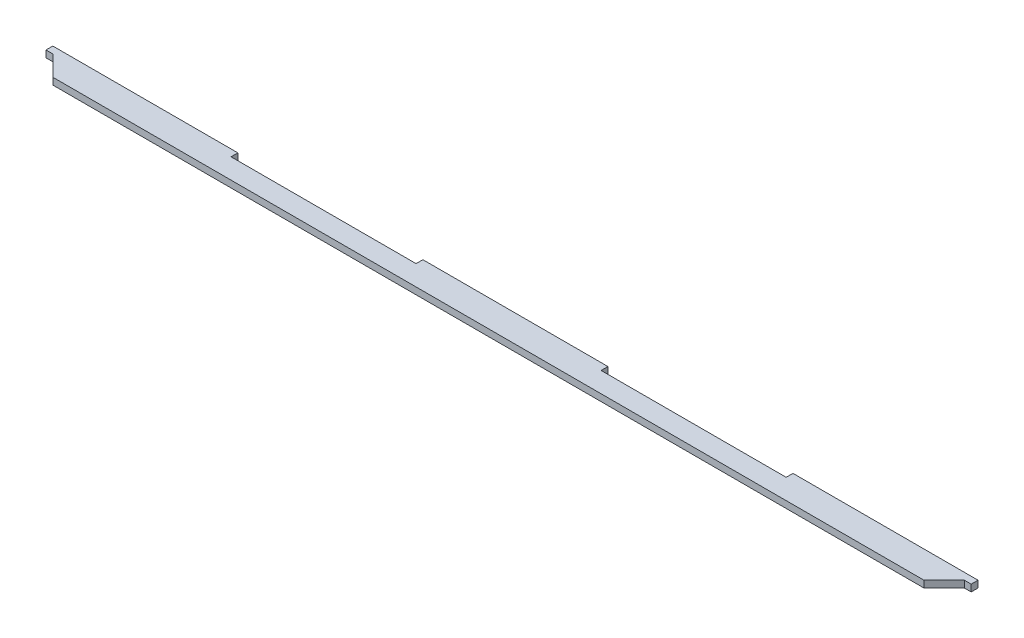
ISO-10303-21;
HEADER;
FILE_DESCRIPTION(('STEP AP214'),'2;1');
FILE_NAME('part.step','',(''),(''),'','','');
FILE_SCHEMA(('AUTOMOTIVE_DESIGN { 1 0 10303 214 1 1 1 1 }'));
ENDSEC;
DATA;
#1=APPLICATION_CONTEXT('core data for automotive mechanical design processes');
#2=APPLICATION_PROTOCOL_DEFINITION('international standard','automotive_design',2000,#1);
#3=PRODUCT_CONTEXT('',#1,'mechanical');
#4=PRODUCT('Part','Part','',(#3));
#5=PRODUCT_RELATED_PRODUCT_CATEGORY('part','',(#4));
#6=PRODUCT_DEFINITION_FORMATION('','',#4);
#7=PRODUCT_DEFINITION_CONTEXT('part definition',#1,'design');
#8=PRODUCT_DEFINITION('design','',#6,#7);
#9=PRODUCT_DEFINITION_SHAPE('','',#8);
#10=(LENGTH_UNIT() NAMED_UNIT(*) SI_UNIT(.MILLI.,.METRE.));
#11=(NAMED_UNIT(*) PLANE_ANGLE_UNIT() SI_UNIT($,.RADIAN.));
#12=(NAMED_UNIT(*) SI_UNIT($,.STERADIAN.) SOLID_ANGLE_UNIT());
#13=UNCERTAINTY_MEASURE_WITH_UNIT(LENGTH_MEASURE(1.E-05),#10,'distance_accuracy_value','');
#14=(GEOMETRIC_REPRESENTATION_CONTEXT(3) GLOBAL_UNCERTAINTY_ASSIGNED_CONTEXT((#13)) GLOBAL_UNIT_ASSIGNED_CONTEXT((#10,
#11,#12)) REPRESENTATION_CONTEXT('',''));
#15=CARTESIAN_POINT('',(0.,0.,0.));
#16=DIRECTION('',(0.,0.,1.));
#17=DIRECTION('',(1.,0.,0.));
#18=AXIS2_PLACEMENT_3D('',#15,#16,#17);
#19=CARTESIAN_POINT('',(-183.2,2.7,-5.10559156911942));
#20=DIRECTION('',(1.,0.,0.));
#21=DIRECTION('',(0.,0.,-1.));
#22=AXIS2_PLACEMENT_3D('',#19,#20,#21);
#23=PLANE('',#22);
#24=DIRECTION('',(0.,0.,1.));
#25=VECTOR('',#24,1.);
#26=CARTESIAN_POINT('',(-183.2,0.,-5.10559156911942));
#27=LINE('',#26,#25);
#28=CARTESIAN_POINT('',(-183.2,0.,-5.10559156911942));
#29=VERTEX_POINT('',#28);
#30=CARTESIAN_POINT('',(-183.2,0.,-2.40559156911942));
#31=VERTEX_POINT('',#30);
#32=EDGE_CURVE('E177',#29,#31,#27,.T.);
#33=ORIENTED_EDGE('',*,*,#32,.T.);
#34=DIRECTION('',(0.,-1.,0.));
#35=VECTOR('',#34,1.);
#36=CARTESIAN_POINT('',(-183.2,2.7,-2.40559156911942));
#37=LINE('',#36,#35);
#38=CARTESIAN_POINT('',(-183.2,2.7,-2.40559156911942));
#39=VERTEX_POINT('',#38);
#40=EDGE_CURVE('E11',#39,#31,#37,.T.);
#41=ORIENTED_EDGE('',*,*,#40,.F.);
#42=DIRECTION('',(0.,0.,1.));
#43=VECTOR('',#42,1.);
#44=CARTESIAN_POINT('',(-183.2,2.7,-5.10559156911942));
#45=LINE('',#44,#43);
#46=CARTESIAN_POINT('',(-183.2,2.7,-5.10559156911942));
#47=VERTEX_POINT('',#46);
#48=EDGE_CURVE('E207',#47,#39,#45,.T.);
#49=ORIENTED_EDGE('',*,*,#48,.F.);
#50=DIRECTION('',(0.,-1.,0.));
#51=VECTOR('',#50,1.);
#52=CARTESIAN_POINT('',(-183.2,2.7,-5.10559156911942));
#53=LINE('',#52,#51);
#54=EDGE_CURVE('E173',#47,#29,#53,.T.);
#55=ORIENTED_EDGE('',*,*,#54,.T.);
#56=EDGE_LOOP('',(#33,#41,#49,#55));
#57=FACE_BOUND('',#56,.T.);
#58=ADVANCED_FACE('F33',(#57),#23,.F.);
#59=CARTESIAN_POINT('',(-183.2,2.7,-2.40559156911942));
#60=DIRECTION('',(0.,0.,-1.));
#61=DIRECTION('',(-1.,0.,0.));
#62=AXIS2_PLACEMENT_3D('',#59,#60,#61);
#63=PLANE('',#62);
#64=DIRECTION('',(1.,0.,0.));
#65=VECTOR('',#64,1.);
#66=CARTESIAN_POINT('',(-183.2,0.,-2.40559156911942));
#67=LINE('',#66,#65);
#68=CARTESIAN_POINT('',(-180.5,0.,-2.40559156911942));
#69=VERTEX_POINT('',#68);
#70=EDGE_CURVE('E180',#31,#69,#67,.T.);
#71=ORIENTED_EDGE('',*,*,#70,.T.);
#72=DIRECTION('',(0.,-1.,0.));
#73=VECTOR('',#72,1.);
#74=CARTESIAN_POINT('',(-180.5,2.7,-2.40559156911942));
#75=LINE('',#74,#73);
#76=CARTESIAN_POINT('',(-180.5,2.7,-2.40559156911942));
#77=VERTEX_POINT('',#76);
#78=EDGE_CURVE('E41',#77,#69,#75,.T.);
#79=ORIENTED_EDGE('',*,*,#78,.F.);
#80=DIRECTION('',(1.,0.,0.));
#81=VECTOR('',#80,1.);
#82=CARTESIAN_POINT('',(-183.2,2.7,-2.40559156911942));
#83=LINE('',#82,#81);
#84=EDGE_CURVE('E116',#39,#77,#83,.T.);
#85=ORIENTED_EDGE('',*,*,#84,.F.);
#86=ORIENTED_EDGE('',*,*,#40,.T.);
#87=EDGE_LOOP('',(#71,#79,#85,#86));
#88=FACE_BOUND('',#87,.T.);
#89=ADVANCED_FACE('F305',(#88),#63,.F.);
#90=CARTESIAN_POINT('',(-180.5,2.7,-2.40559156911942));
#91=DIRECTION('',(0.707106781186539,0.,-0.707106781186556));
#92=DIRECTION('',(-0.707106781186556,0.,-0.707106781186539));
#93=AXIS2_PLACEMENT_3D('',#90,#91,#92);
#94=PLANE('',#93);
#95=DIRECTION('',(0.707106781186556,0.,0.707106781186539));
#96=VECTOR('',#95,1.);
#97=CARTESIAN_POINT('',(-180.5,0.,-2.40559156911942));
#98=LINE('',#97,#96);
#99=CARTESIAN_POINT('',(-172.5,0.,5.59440843088058));
#100=VERTEX_POINT('',#99);
#101=EDGE_CURVE('E182',#69,#100,#98,.T.);
#102=ORIENTED_EDGE('',*,*,#101,.T.);
#103=DIRECTION('',(0.,-1.,0.));
#104=VECTOR('',#103,1.);
#105=CARTESIAN_POINT('',(-172.5,2.7,5.59440843088058));
#106=LINE('',#105,#104);
#107=CARTESIAN_POINT('',(-172.5,2.7,5.59440843088058));
#108=VERTEX_POINT('',#107);
#109=EDGE_CURVE('E238',#108,#100,#106,.T.);
#110=ORIENTED_EDGE('',*,*,#109,.F.);
#111=DIRECTION('',(0.707106781186556,0.,0.707106781186539));
#112=VECTOR('',#111,1.);
#113=CARTESIAN_POINT('',(-180.5,2.7,-2.40559156911942));
#114=LINE('',#113,#112);
#115=EDGE_CURVE('E246',#77,#108,#114,.T.);
#116=ORIENTED_EDGE('',*,*,#115,.F.);
#117=ORIENTED_EDGE('',*,*,#78,.T.);
#118=EDGE_LOOP('',(#102,#110,#116,#117));
#119=FACE_BOUND('',#118,.T.);
#120=ADVANCED_FACE('F244',(#119),#94,.F.);
#121=CARTESIAN_POINT('',(-172.5,2.7,5.59440843088058));
#122=DIRECTION('',(0.,0.,-1.));
#123=DIRECTION('',(-1.,0.,0.));
#124=AXIS2_PLACEMENT_3D('',#121,#122,#123);
#125=PLANE('',#124);
#126=DIRECTION('',(1.,0.,0.));
#127=VECTOR('',#126,1.);
#128=CARTESIAN_POINT('',(-172.5,0.,5.59440843088058));
#129=LINE('',#128,#127);
#130=CARTESIAN_POINT('',(172.5,0.,5.59440843088058));
#131=VERTEX_POINT('',#130);
#132=EDGE_CURVE('E184',#100,#131,#129,.T.);
#133=ORIENTED_EDGE('',*,*,#132,.T.);
#134=DIRECTION('',(0.,-1.,0.));
#135=VECTOR('',#134,1.);
#136=CARTESIAN_POINT('',(172.5,2.7,5.59440843088058));
#137=LINE('',#136,#135);
#138=CARTESIAN_POINT('',(172.5,2.7,5.59440843088058));
#139=VERTEX_POINT('',#138);
#140=EDGE_CURVE('E235',#139,#131,#137,.T.);
#141=ORIENTED_EDGE('',*,*,#140,.F.);
#142=DIRECTION('',(1.,0.,0.));
#143=VECTOR('',#142,1.);
#144=CARTESIAN_POINT('',(-172.5,2.7,5.59440843088058));
#145=LINE('',#144,#143);
#146=EDGE_CURVE('E264',#108,#139,#145,.T.);
#147=ORIENTED_EDGE('',*,*,#146,.F.);
#148=ORIENTED_EDGE('',*,*,#109,.T.);
#149=EDGE_LOOP('',(#133,#141,#147,#148));
#150=FACE_BOUND('',#149,.T.);
#151=ADVANCED_FACE('F255',(#150),#125,.F.);
#152=CARTESIAN_POINT('',(180.5,2.7,-2.40559156911942));
#153=DIRECTION('',(-0.707106781186539,0.,-0.707106781186556));
#154=DIRECTION('',(-0.707106781186556,0.,0.707106781186539));
#155=AXIS2_PLACEMENT_3D('',#152,#153,#154);
#156=PLANE('',#155);
#157=DIRECTION('',(0.707106781186556,0.,-0.707106781186539));
#158=VECTOR('',#157,1.);
#159=CARTESIAN_POINT('',(180.5,0.,-2.40559156911942));
#160=LINE('',#159,#158);
#161=CARTESIAN_POINT('',(180.5,0.,-2.40559156911942));
#162=VERTEX_POINT('',#161);
#163=EDGE_CURVE('E186',#131,#162,#160,.T.);
#164=ORIENTED_EDGE('',*,*,#163,.T.);
#165=DIRECTION('',(0.,-1.,0.));
#166=VECTOR('',#165,1.);
#167=CARTESIAN_POINT('',(180.5,2.7,-2.40559156911942));
#168=LINE('',#167,#166);
#169=CARTESIAN_POINT('',(180.5,2.7,-2.40559156911942));
#170=VERTEX_POINT('',#169);
#171=EDGE_CURVE('E232',#170,#162,#168,.T.);
#172=ORIENTED_EDGE('',*,*,#171,.F.);
#173=DIRECTION('',(0.707106781186556,0.,-0.707106781186539));
#174=VECTOR('',#173,1.);
#175=CARTESIAN_POINT('',(180.5,2.7,-2.40559156911942));
#176=LINE('',#175,#174);
#177=EDGE_CURVE('E261',#139,#170,#176,.T.);
#178=ORIENTED_EDGE('',*,*,#177,.F.);
#179=ORIENTED_EDGE('',*,*,#140,.T.);
#180=EDGE_LOOP('',(#164,#172,#178,#179));
#181=FACE_BOUND('',#180,.T.);
#182=ADVANCED_FACE('F259',(#181),#156,.F.);
#183=CARTESIAN_POINT('',(180.5,2.7,-2.40559156911942));
#184=DIRECTION('',(0.,0.,-1.));
#185=DIRECTION('',(-1.,0.,0.));
#186=AXIS2_PLACEMENT_3D('',#183,#184,#185);
#187=PLANE('',#186);
#188=DIRECTION('',(1.,0.,0.));
#189=VECTOR('',#188,1.);
#190=CARTESIAN_POINT('',(180.5,0.,-2.40559156911942));
#191=LINE('',#190,#189);
#192=CARTESIAN_POINT('',(183.2,0.,-2.40559156911942));
#193=VERTEX_POINT('',#192);
#194=EDGE_CURVE('E188',#162,#193,#191,.T.);
#195=ORIENTED_EDGE('',*,*,#194,.T.);
#196=DIRECTION('',(0.,-1.,0.));
#197=VECTOR('',#196,1.);
#198=CARTESIAN_POINT('',(183.2,2.7,-2.40559156911942));
#199=LINE('',#198,#197);
#200=CARTESIAN_POINT('',(183.2,2.7,-2.40559156911942));
#201=VERTEX_POINT('',#200);
#202=EDGE_CURVE('E229',#201,#193,#199,.T.);
#203=ORIENTED_EDGE('',*,*,#202,.F.);
#204=DIRECTION('',(1.,0.,0.));
#205=VECTOR('',#204,1.);
#206=CARTESIAN_POINT('',(180.5,2.7,-2.40559156911942));
#207=LINE('',#206,#205);
#208=EDGE_CURVE('E263',#170,#201,#207,.T.);
#209=ORIENTED_EDGE('',*,*,#208,.F.);
#210=ORIENTED_EDGE('',*,*,#171,.T.);
#211=EDGE_LOOP('',(#195,#203,#209,#210));
#212=FACE_BOUND('',#211,.T.);
#213=ADVANCED_FACE('F318',(#212),#187,.F.);
#214=CARTESIAN_POINT('',(183.2,2.7,-5.10559156911942));
#215=DIRECTION('',(-1.,0.,0.));
#216=DIRECTION('',(0.,0.,1.));
#217=AXIS2_PLACEMENT_3D('',#214,#215,#216);
#218=PLANE('',#217);
#219=DIRECTION('',(0.,0.,-1.));
#220=VECTOR('',#219,1.);
#221=CARTESIAN_POINT('',(183.2,0.,-5.10559156911942));
#222=LINE('',#221,#220);
#223=CARTESIAN_POINT('',(183.2,0.,-5.10559156911942));
#224=VERTEX_POINT('',#223);
#225=EDGE_CURVE('E190',#193,#224,#222,.T.);
#226=ORIENTED_EDGE('',*,*,#225,.T.);
#227=DIRECTION('',(0.,-1.,0.));
#228=VECTOR('',#227,1.);
#229=CARTESIAN_POINT('',(183.2,2.7,-5.10559156911942));
#230=LINE('',#229,#228);
#231=CARTESIAN_POINT('',(183.2,2.7,-5.10559156911942));
#232=VERTEX_POINT('',#231);
#233=EDGE_CURVE('E226',#232,#224,#230,.T.);
#234=ORIENTED_EDGE('',*,*,#233,.F.);
#235=DIRECTION('',(0.,0.,-1.));
#236=VECTOR('',#235,1.);
#237=CARTESIAN_POINT('',(183.2,2.7,-5.10559156911942));
#238=LINE('',#237,#236);
#239=EDGE_CURVE('E266',#201,#232,#238,.T.);
#240=ORIENTED_EDGE('',*,*,#239,.F.);
#241=ORIENTED_EDGE('',*,*,#202,.T.);
#242=EDGE_LOOP('',(#226,#234,#240,#241));
#243=FACE_BOUND('',#242,.T.);
#244=ADVANCED_FACE('F321',(#243),#218,.F.);
#245=CARTESIAN_POINT('',(109.92,2.7,-5.10559156911942));
#246=DIRECTION('',(0.,0.,1.));
#247=DIRECTION('',(1.,0.,0.));
#248=AXIS2_PLACEMENT_3D('',#245,#246,#247);
#249=PLANE('',#248);
#250=DIRECTION('',(-1.,0.,0.));
#251=VECTOR('',#250,1.);
#252=CARTESIAN_POINT('',(109.92,0.,-5.10559156911942));
#253=LINE('',#252,#251);
#254=CARTESIAN_POINT('',(109.92,0.,-5.10559156911942));
#255=VERTEX_POINT('',#254);
#256=EDGE_CURVE('E192',#224,#255,#253,.T.);
#257=ORIENTED_EDGE('',*,*,#256,.T.);
#258=DIRECTION('',(0.,-1.,0.));
#259=VECTOR('',#258,1.);
#260=CARTESIAN_POINT('',(109.92,2.7,-5.10559156911942));
#261=LINE('',#260,#259);
#262=CARTESIAN_POINT('',(109.92,2.7,-5.10559156911942));
#263=VERTEX_POINT('',#262);
#264=EDGE_CURVE('E223',#263,#255,#261,.T.);
#265=ORIENTED_EDGE('',*,*,#264,.F.);
#266=DIRECTION('',(-1.,0.,0.));
#267=VECTOR('',#266,1.);
#268=CARTESIAN_POINT('',(109.92,2.7,-5.10559156911942));
#269=LINE('',#268,#267);
#270=EDGE_CURVE('E272',#232,#263,#269,.T.);
#271=ORIENTED_EDGE('',*,*,#270,.F.);
#272=ORIENTED_EDGE('',*,*,#233,.T.);
#273=EDGE_LOOP('',(#257,#265,#271,#272));
#274=FACE_BOUND('',#273,.T.);
#275=ADVANCED_FACE('F325',(#274),#249,.F.);
#276=CARTESIAN_POINT('',(109.92,2.7,-5.10559156911942));
#277=DIRECTION('',(1.,0.,0.));
#278=DIRECTION('',(0.,0.,-1.));
#279=AXIS2_PLACEMENT_3D('',#276,#277,#278);
#280=PLANE('',#279);
#281=DIRECTION('',(0.,0.,1.));
#282=VECTOR('',#281,1.);
#283=CARTESIAN_POINT('',(109.92,0.,-5.10559156911942));
#284=LINE('',#283,#282);
#285=CARTESIAN_POINT('',(109.92,0.,-2.40559156911942));
#286=VERTEX_POINT('',#285);
#287=EDGE_CURVE('E194',#255,#286,#284,.T.);
#288=ORIENTED_EDGE('',*,*,#287,.T.);
#289=DIRECTION('',(0.,-1.,0.));
#290=VECTOR('',#289,1.);
#291=CARTESIAN_POINT('',(109.92,2.7,-2.40559156911942));
#292=LINE('',#291,#290);
#293=CARTESIAN_POINT('',(109.92,2.7,-2.40559156911942));
#294=VERTEX_POINT('',#293);
#295=EDGE_CURVE('E220',#294,#286,#292,.T.);
#296=ORIENTED_EDGE('',*,*,#295,.F.);
#297=DIRECTION('',(0.,0.,1.));
#298=VECTOR('',#297,1.);
#299=CARTESIAN_POINT('',(109.92,2.7,-5.10559156911942));
#300=LINE('',#299,#298);
#301=EDGE_CURVE('E274',#263,#294,#300,.T.);
#302=ORIENTED_EDGE('',*,*,#301,.F.);
#303=ORIENTED_EDGE('',*,*,#264,.T.);
#304=EDGE_LOOP('',(#288,#296,#302,#303));
#305=FACE_BOUND('',#304,.T.);
#306=ADVANCED_FACE('F329',(#305),#280,.F.);
#307=CARTESIAN_POINT('',(36.6400000000001,2.7,-2.40559156911942));
#308=DIRECTION('',(0.,0.,1.));
#309=DIRECTION('',(1.,0.,0.));
#310=AXIS2_PLACEMENT_3D('',#307,#308,#309);
#311=PLANE('',#310);
#312=DIRECTION('',(-1.,0.,0.));
#313=VECTOR('',#312,1.);
#314=CARTESIAN_POINT('',(36.6400000000001,0.,-2.40559156911942));
#315=LINE('',#314,#313);
#316=CARTESIAN_POINT('',(36.6400000000001,0.,-2.40559156911942));
#317=VERTEX_POINT('',#316);
#318=EDGE_CURVE('E196',#286,#317,#315,.T.);
#319=ORIENTED_EDGE('',*,*,#318,.T.);
#320=DIRECTION('',(0.,-1.,0.));
#321=VECTOR('',#320,1.);
#322=CARTESIAN_POINT('',(36.6400000000001,2.7,-2.40559156911942));
#323=LINE('',#322,#321);
#324=CARTESIAN_POINT('',(36.6400000000001,2.7,-2.40559156911942));
#325=VERTEX_POINT('',#324);
#326=EDGE_CURVE('E217',#325,#317,#323,.T.);
#327=ORIENTED_EDGE('',*,*,#326,.F.);
#328=DIRECTION('',(-1.,0.,0.));
#329=VECTOR('',#328,1.);
#330=CARTESIAN_POINT('',(36.6400000000001,2.7,-2.40559156911942));
#331=LINE('',#330,#329);
#332=EDGE_CURVE('E276',#294,#325,#331,.T.);
#333=ORIENTED_EDGE('',*,*,#332,.F.);
#334=ORIENTED_EDGE('',*,*,#295,.T.);
#335=EDGE_LOOP('',(#319,#327,#333,#334));
#336=FACE_BOUND('',#335,.T.);
#337=ADVANCED_FACE('F333',(#336),#311,.F.);
#338=CARTESIAN_POINT('',(36.6400000000001,2.7,-5.10559156911942));
#339=DIRECTION('',(-1.,0.,0.));
#340=DIRECTION('',(0.,0.,1.));
#341=AXIS2_PLACEMENT_3D('',#338,#339,#340);
#342=PLANE('',#341);
#343=DIRECTION('',(0.,0.,-1.));
#344=VECTOR('',#343,1.);
#345=CARTESIAN_POINT('',(36.6400000000001,0.,-5.10559156911942));
#346=LINE('',#345,#344);
#347=CARTESIAN_POINT('',(36.6400000000001,0.,-5.10559156911942));
#348=VERTEX_POINT('',#347);
#349=EDGE_CURVE('E198',#317,#348,#346,.T.);
#350=ORIENTED_EDGE('',*,*,#349,.T.);
#351=DIRECTION('',(0.,-1.,0.));
#352=VECTOR('',#351,1.);
#353=CARTESIAN_POINT('',(36.6400000000001,2.7,-5.10559156911942));
#354=LINE('',#353,#352);
#355=CARTESIAN_POINT('',(36.6400000000001,2.7,-5.10559156911942));
#356=VERTEX_POINT('',#355);
#357=EDGE_CURVE('E214',#356,#348,#354,.T.);
#358=ORIENTED_EDGE('',*,*,#357,.F.);
#359=DIRECTION('',(0.,0.,-1.));
#360=VECTOR('',#359,1.);
#361=CARTESIAN_POINT('',(36.6400000000001,2.7,-5.10559156911942));
#362=LINE('',#361,#360);
#363=EDGE_CURVE('E278',#325,#356,#362,.T.);
#364=ORIENTED_EDGE('',*,*,#363,.F.);
#365=ORIENTED_EDGE('',*,*,#326,.T.);
#366=EDGE_LOOP('',(#350,#358,#364,#365));
#367=FACE_BOUND('',#366,.T.);
#368=ADVANCED_FACE('F337',(#367),#342,.F.);
#369=CARTESIAN_POINT('',(-36.6399999999999,2.7,-5.10559156911942));
#370=DIRECTION('',(0.,0.,1.));
#371=DIRECTION('',(1.,0.,0.));
#372=AXIS2_PLACEMENT_3D('',#369,#370,#371);
#373=PLANE('',#372);
#374=DIRECTION('',(-1.,0.,0.));
#375=VECTOR('',#374,1.);
#376=CARTESIAN_POINT('',(-36.6399999999999,0.,-5.10559156911942));
#377=LINE('',#376,#375);
#378=CARTESIAN_POINT('',(-36.6399999999999,0.,-5.10559156911942));
#379=VERTEX_POINT('',#378);
#380=EDGE_CURVE('E200',#348,#379,#377,.T.);
#381=ORIENTED_EDGE('',*,*,#380,.T.);
#382=DIRECTION('',(0.,-1.,0.));
#383=VECTOR('',#382,1.);
#384=CARTESIAN_POINT('',(-36.6399999999999,2.7,-5.10559156911942));
#385=LINE('',#384,#383);
#386=CARTESIAN_POINT('',(-36.6399999999999,2.7,-5.10559156911942));
#387=VERTEX_POINT('',#386);
#388=EDGE_CURVE('E211',#387,#379,#385,.T.);
#389=ORIENTED_EDGE('',*,*,#388,.F.);
#390=DIRECTION('',(-1.,0.,0.));
#391=VECTOR('',#390,1.);
#392=CARTESIAN_POINT('',(-36.6399999999999,2.7,-5.10559156911942));
#393=LINE('',#392,#391);
#394=EDGE_CURVE('E280',#356,#387,#393,.T.);
#395=ORIENTED_EDGE('',*,*,#394,.F.);
#396=ORIENTED_EDGE('',*,*,#357,.T.);
#397=EDGE_LOOP('',(#381,#389,#395,#396));
#398=FACE_BOUND('',#397,.T.);
#399=ADVANCED_FACE('F286',(#398),#373,.F.);
#400=CARTESIAN_POINT('',(-36.6399999999999,2.7,-5.10559156911942));
#401=DIRECTION('',(1.,0.,0.));
#402=DIRECTION('',(0.,0.,-1.));
#403=AXIS2_PLACEMENT_3D('',#400,#401,#402);
#404=PLANE('',#403);
#405=DIRECTION('',(0.,0.,1.));
#406=VECTOR('',#405,1.);
#407=CARTESIAN_POINT('',(-36.6399999999999,0.,-5.10559156911942));
#408=LINE('',#407,#406);
#409=CARTESIAN_POINT('',(-36.6399999999999,0.,-2.40559156911942));
#410=VERTEX_POINT('',#409);
#411=EDGE_CURVE('E202',#379,#410,#408,.T.);
#412=ORIENTED_EDGE('',*,*,#411,.T.);
#413=DIRECTION('',(0.,-1.,0.));
#414=VECTOR('',#413,1.);
#415=CARTESIAN_POINT('',(-36.6399999999999,2.7,-2.40559156911942));
#416=LINE('',#415,#414);
#417=CARTESIAN_POINT('',(-36.6399999999999,2.7,-2.40559156911942));
#418=VERTEX_POINT('',#417);
#419=EDGE_CURVE('E168',#418,#410,#416,.T.);
#420=ORIENTED_EDGE('',*,*,#419,.F.);
#421=DIRECTION('',(0.,0.,1.));
#422=VECTOR('',#421,1.);
#423=CARTESIAN_POINT('',(-36.6399999999999,2.7,-5.10559156911942));
#424=LINE('',#423,#422);
#425=EDGE_CURVE('E159',#387,#418,#424,.T.);
#426=ORIENTED_EDGE('',*,*,#425,.F.);
#427=ORIENTED_EDGE('',*,*,#388,.T.);
#428=EDGE_LOOP('',(#412,#420,#426,#427));
#429=FACE_BOUND('',#428,.T.);
#430=ADVANCED_FACE('F290',(#429),#404,.F.);
#431=CARTESIAN_POINT('',(-109.92,2.7,-2.40559156911942));
#432=DIRECTION('',(0.,0.,1.));
#433=DIRECTION('',(1.,0.,0.));
#434=AXIS2_PLACEMENT_3D('',#431,#432,#433);
#435=PLANE('',#434);
#436=DIRECTION('',(-1.,0.,0.));
#437=VECTOR('',#436,1.);
#438=CARTESIAN_POINT('',(-109.92,0.,-2.40559156911942));
#439=LINE('',#438,#437);
#440=CARTESIAN_POINT('',(-109.92,0.,-2.40559156911942));
#441=VERTEX_POINT('',#440);
#442=EDGE_CURVE('E167',#410,#441,#439,.T.);
#443=ORIENTED_EDGE('',*,*,#442,.T.);
#444=DIRECTION('',(0.,-1.,0.));
#445=VECTOR('',#444,1.);
#446=CARTESIAN_POINT('',(-109.92,2.7,-2.40559156911942));
#447=LINE('',#446,#445);
#448=CARTESIAN_POINT('',(-109.92,2.7,-2.40559156911942));
#449=VERTEX_POINT('',#448);
#450=EDGE_CURVE('E164',#449,#441,#447,.T.);
#451=ORIENTED_EDGE('',*,*,#450,.F.);
#452=DIRECTION('',(-1.,0.,0.));
#453=VECTOR('',#452,1.);
#454=CARTESIAN_POINT('',(-109.92,2.7,-2.40559156911942));
#455=LINE('',#454,#453);
#456=EDGE_CURVE('E153',#418,#449,#455,.T.);
#457=ORIENTED_EDGE('',*,*,#456,.F.);
#458=ORIENTED_EDGE('',*,*,#419,.T.);
#459=EDGE_LOOP('',(#443,#451,#457,#458));
#460=FACE_BOUND('',#459,.T.);
#461=ADVANCED_FACE('F165',(#460),#435,.F.);
#462=CARTESIAN_POINT('',(-109.92,2.7,-5.10559156911942));
#463=DIRECTION('',(-1.,0.,0.));
#464=DIRECTION('',(0.,0.,1.));
#465=AXIS2_PLACEMENT_3D('',#462,#463,#464);
#466=PLANE('',#465);
#467=DIRECTION('',(0.,0.,-1.));
#468=VECTOR('',#467,1.);
#469=CARTESIAN_POINT('',(-109.92,0.,-5.10559156911942));
#470=LINE('',#469,#468);
#471=CARTESIAN_POINT('',(-109.92,0.,-5.10559156911942));
#472=VERTEX_POINT('',#471);
#473=EDGE_CURVE('E102',#441,#472,#470,.T.);
#474=ORIENTED_EDGE('',*,*,#473,.T.);
#475=DIRECTION('',(0.,-1.,0.));
#476=VECTOR('',#475,1.);
#477=CARTESIAN_POINT('',(-109.92,2.7,-5.10559156911942));
#478=LINE('',#477,#476);
#479=CARTESIAN_POINT('',(-109.92,2.7,-5.10559156911942));
#480=VERTEX_POINT('',#479);
#481=EDGE_CURVE('E169',#480,#472,#478,.T.);
#482=ORIENTED_EDGE('',*,*,#481,.F.);
#483=DIRECTION('',(0.,0.,-1.));
#484=VECTOR('',#483,1.);
#485=CARTESIAN_POINT('',(-109.92,2.7,-5.10559156911942));
#486=LINE('',#485,#484);
#487=EDGE_CURVE('E157',#449,#480,#486,.T.);
#488=ORIENTED_EDGE('',*,*,#487,.F.);
#489=ORIENTED_EDGE('',*,*,#450,.T.);
#490=EDGE_LOOP('',(#474,#482,#488,#489));
#491=FACE_BOUND('',#490,.T.);
#492=ADVANCED_FACE('F171',(#491),#466,.F.);
#493=CARTESIAN_POINT('',(-183.2,2.7,-5.10559156911942));
#494=DIRECTION('',(0.,0.,1.));
#495=DIRECTION('',(1.,0.,0.));
#496=AXIS2_PLACEMENT_3D('',#493,#494,#495);
#497=PLANE('',#496);
#498=DIRECTION('',(-1.,0.,0.));
#499=VECTOR('',#498,1.);
#500=CARTESIAN_POINT('',(-183.2,0.,-5.10559156911942));
#501=LINE('',#500,#499);
#502=EDGE_CURVE('E108',#472,#29,#501,.T.);
#503=ORIENTED_EDGE('',*,*,#502,.T.);
#504=ORIENTED_EDGE('',*,*,#54,.F.);
#505=DIRECTION('',(-1.,0.,0.));
#506=VECTOR('',#505,1.);
#507=CARTESIAN_POINT('',(-183.2,2.7,-5.10559156911942));
#508=LINE('',#507,#506);
#509=EDGE_CURVE('E49',#480,#47,#508,.T.);
#510=ORIENTED_EDGE('',*,*,#509,.F.);
#511=ORIENTED_EDGE('',*,*,#481,.T.);
#512=EDGE_LOOP('',(#503,#504,#510,#511));
#513=FACE_BOUND('',#512,.T.);
#514=ADVANCED_FACE('F294',(#513),#497,.F.);
#515=CARTESIAN_POINT('',(0.,2.7,0.));
#516=DIRECTION('',(0.,1.,0.));
#517=DIRECTION('',(0.,0.,1.));
#518=AXIS2_PLACEMENT_3D('',#515,#516,#517);
#519=PLANE('',#518);
#520=ORIENTED_EDGE('',*,*,#48,.T.);
#521=ORIENTED_EDGE('',*,*,#84,.T.);
#522=ORIENTED_EDGE('',*,*,#115,.T.);
#523=ORIENTED_EDGE('',*,*,#146,.T.);
#524=ORIENTED_EDGE('',*,*,#177,.T.);
#525=ORIENTED_EDGE('',*,*,#208,.T.);
#526=ORIENTED_EDGE('',*,*,#239,.T.);
#527=ORIENTED_EDGE('',*,*,#270,.T.);
#528=ORIENTED_EDGE('',*,*,#301,.T.);
#529=ORIENTED_EDGE('',*,*,#332,.T.);
#530=ORIENTED_EDGE('',*,*,#363,.T.);
#531=ORIENTED_EDGE('',*,*,#394,.T.);
#532=ORIENTED_EDGE('',*,*,#425,.T.);
#533=ORIENTED_EDGE('',*,*,#456,.T.);
#534=ORIENTED_EDGE('',*,*,#487,.T.);
#535=ORIENTED_EDGE('',*,*,#509,.T.);
#536=EDGE_LOOP('',(#520,#521,#522,#523,#524,#525,#526,#527,#528,#529,#530,#531,#532,#533,#534,#535));
#537=FACE_BOUND('',#536,.T.);
#538=ADVANCED_FACE('F155',(#537),#519,.T.);
#539=CARTESIAN_POINT('',(0.,0.,0.));
#540=DIRECTION('',(0.,1.,0.));
#541=DIRECTION('',(0.,0.,1.));
#542=AXIS2_PLACEMENT_3D('',#539,#540,#541);
#543=PLANE('',#542);
#544=ORIENTED_EDGE('',*,*,#32,.F.);
#545=ORIENTED_EDGE('',*,*,#502,.F.);
#546=ORIENTED_EDGE('',*,*,#473,.F.);
#547=ORIENTED_EDGE('',*,*,#442,.F.);
#548=ORIENTED_EDGE('',*,*,#411,.F.);
#549=ORIENTED_EDGE('',*,*,#380,.F.);
#550=ORIENTED_EDGE('',*,*,#349,.F.);
#551=ORIENTED_EDGE('',*,*,#318,.F.);
#552=ORIENTED_EDGE('',*,*,#287,.F.);
#553=ORIENTED_EDGE('',*,*,#256,.F.);
#554=ORIENTED_EDGE('',*,*,#225,.F.);
#555=ORIENTED_EDGE('',*,*,#194,.F.);
#556=ORIENTED_EDGE('',*,*,#163,.F.);
#557=ORIENTED_EDGE('',*,*,#132,.F.);
#558=ORIENTED_EDGE('',*,*,#101,.F.);
#559=ORIENTED_EDGE('',*,*,#70,.F.);
#560=EDGE_LOOP('',(#544,#545,#546,#547,#548,#549,#550,#551,#552,#553,#554,#555,#556,#557,#558,#559));
#561=FACE_BOUND('',#560,.T.);
#562=ADVANCED_FACE('F250',(#561),#543,.F.);
#563=CLOSED_SHELL('',(#58,#89,#120,#151,#182,#213,#244,#275,#306,#337,#368,#399,#430,#461,#492,
#514,#538,#562));
#564=MANIFOLD_SOLID_BREP('B2',#563);
#565=ADVANCED_BREP_SHAPE_REPRESENTATION('',(#18,#564),#14);
#566=SHAPE_DEFINITION_REPRESENTATION(#9,#565);
ENDSEC;
END-ISO-10303-21;
